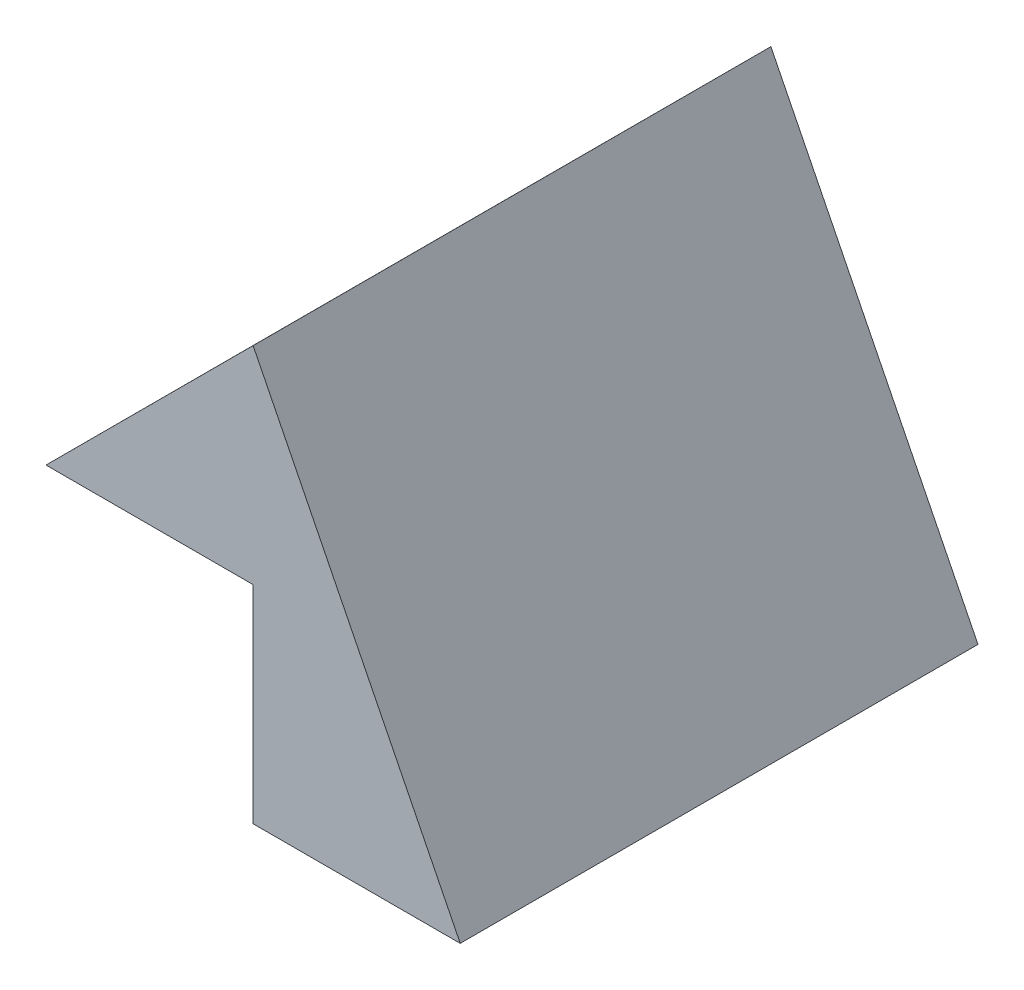
ISO-10303-21;
HEADER;
FILE_DESCRIPTION(('STEP AP214'),'2;1');
FILE_NAME('part.step','',(''),(''),'','','');
FILE_SCHEMA(('AUTOMOTIVE_DESIGN { 1 0 10303 214 1 1 1 1 }'));
ENDSEC;
DATA;
#1=APPLICATION_CONTEXT('core data for automotive mechanical design processes');
#2=APPLICATION_PROTOCOL_DEFINITION('international standard','automotive_design',2000,#1);
#3=PRODUCT_CONTEXT('',#1,'mechanical');
#4=PRODUCT('Part','Part','',(#3));
#5=PRODUCT_RELATED_PRODUCT_CATEGORY('part','',(#4));
#6=PRODUCT_DEFINITION_FORMATION('','',#4);
#7=PRODUCT_DEFINITION_CONTEXT('part definition',#1,'design');
#8=PRODUCT_DEFINITION('design','',#6,#7);
#9=PRODUCT_DEFINITION_SHAPE('','',#8);
#10=(LENGTH_UNIT() NAMED_UNIT(*) SI_UNIT(.MILLI.,.METRE.));
#11=(NAMED_UNIT(*) PLANE_ANGLE_UNIT() SI_UNIT($,.RADIAN.));
#12=(NAMED_UNIT(*) SI_UNIT($,.STERADIAN.) SOLID_ANGLE_UNIT());
#13=UNCERTAINTY_MEASURE_WITH_UNIT(LENGTH_MEASURE(1.E-05),#10,'distance_accuracy_value','');
#14=(GEOMETRIC_REPRESENTATION_CONTEXT(3) GLOBAL_UNCERTAINTY_ASSIGNED_CONTEXT((#13)) GLOBAL_UNIT_ASSIGNED_CONTEXT((#10,
#11,#12)) REPRESENTATION_CONTEXT('',''));
#15=CARTESIAN_POINT('',(0.,0.,0.));
#16=DIRECTION('',(0.,0.,1.));
#17=DIRECTION('',(1.,0.,0.));
#18=AXIS2_PLACEMENT_3D('',#15,#16,#17);
#19=CARTESIAN_POINT('',(-10.,10.,25.));
#20=DIRECTION('',(0.,1.,0.));
#21=DIRECTION('',(0.,0.,1.));
#22=AXIS2_PLACEMENT_3D('',#19,#20,#21);
#23=PLANE('',#22);
#24=DIRECTION('',(1.,0.,0.));
#25=VECTOR('',#24,1.);
#26=CARTESIAN_POINT('',(-10.,10.,0.));
#27=LINE('',#26,#25);
#28=CARTESIAN_POINT('',(-20.,10.,0.));
#29=VERTEX_POINT('',#28);
#30=CARTESIAN_POINT('',(-10.,10.,0.));
#31=VERTEX_POINT('',#30);
#32=EDGE_CURVE('E107',#29,#31,#27,.T.);
#33=ORIENTED_EDGE('',*,*,#32,.T.);
#34=DIRECTION('',(0.,0.,-1.));
#35=VECTOR('',#34,1.);
#36=CARTESIAN_POINT('',(-10.,10.,25.));
#37=LINE('',#36,#35);
#38=CARTESIAN_POINT('',(-10.,10.,25.));
#39=VERTEX_POINT('',#38);
#40=EDGE_CURVE('E11',#39,#31,#37,.T.);
#41=ORIENTED_EDGE('',*,*,#40,.F.);
#42=DIRECTION('',(1.,0.,0.));
#43=VECTOR('',#42,1.);
#44=CARTESIAN_POINT('',(-10.,10.,25.));
#45=LINE('',#44,#43);
#46=CARTESIAN_POINT('',(-20.,10.,25.));
#47=VERTEX_POINT('',#46);
#48=EDGE_CURVE('E115',#47,#39,#45,.T.);
#49=ORIENTED_EDGE('',*,*,#48,.F.);
#50=DIRECTION('',(0.,0.,-1.));
#51=VECTOR('',#50,1.);
#52=CARTESIAN_POINT('',(-20.,10.,25.));
#53=LINE('',#52,#51);
#54=EDGE_CURVE('E103',#47,#29,#53,.T.);
#55=ORIENTED_EDGE('',*,*,#54,.T.);
#56=EDGE_LOOP('',(#33,#41,#49,#55));
#57=FACE_BOUND('',#56,.T.);
#58=ADVANCED_FACE('F33',(#57),#23,.F.);
#59=CARTESIAN_POINT('',(-10.,0.,25.));
#60=DIRECTION('',(1.,0.,0.));
#61=DIRECTION('',(0.,0.,-1.));
#62=AXIS2_PLACEMENT_3D('',#59,#60,#61);
#63=PLANE('',#62);
#64=DIRECTION('',(0.,-1.,0.));
#65=VECTOR('',#64,1.);
#66=CARTESIAN_POINT('',(-10.,0.,0.));
#67=LINE('',#66,#65);
#68=CARTESIAN_POINT('',(-10.,0.,0.));
#69=VERTEX_POINT('',#68);
#70=EDGE_CURVE('E110',#31,#69,#67,.T.);
#71=ORIENTED_EDGE('',*,*,#70,.T.);
#72=DIRECTION('',(0.,0.,-1.));
#73=VECTOR('',#72,1.);
#74=CARTESIAN_POINT('',(-10.,0.,25.));
#75=LINE('',#74,#73);
#76=CARTESIAN_POINT('',(-10.,0.,25.));
#77=VERTEX_POINT('',#76);
#78=EDGE_CURVE('E41',#77,#69,#75,.T.);
#79=ORIENTED_EDGE('',*,*,#78,.F.);
#80=DIRECTION('',(0.,-1.,0.));
#81=VECTOR('',#80,1.);
#82=CARTESIAN_POINT('',(-10.,0.,25.));
#83=LINE('',#82,#81);
#84=EDGE_CURVE('E83',#39,#77,#83,.T.);
#85=ORIENTED_EDGE('',*,*,#84,.F.);
#86=ORIENTED_EDGE('',*,*,#40,.T.);
#87=EDGE_LOOP('',(#71,#79,#85,#86));
#88=FACE_BOUND('',#87,.T.);
#89=ADVANCED_FACE('F134',(#88),#63,.F.);
#90=CARTESIAN_POINT('',(0.,0.,25.));
#91=DIRECTION('',(0.,1.,0.));
#92=DIRECTION('',(-1.,0.,0.));
#93=AXIS2_PLACEMENT_3D('',#90,#91,#92);
#94=PLANE('',#93);
#95=DIRECTION('',(1.,0.,0.));
#96=VECTOR('',#95,1.);
#97=CARTESIAN_POINT('',(0.,0.,0.));
#98=LINE('',#97,#96);
#99=CARTESIAN_POINT('',(0.,0.,0.));
#100=VERTEX_POINT('',#99);
#101=EDGE_CURVE('E98',#69,#100,#98,.T.);
#102=ORIENTED_EDGE('',*,*,#101,.T.);
#103=DIRECTION('',(0.,0.,-1.));
#104=VECTOR('',#103,1.);
#105=CARTESIAN_POINT('',(0.,0.,25.));
#106=LINE('',#105,#104);
#107=CARTESIAN_POINT('',(0.,0.,25.));
#108=VERTEX_POINT('',#107);
#109=EDGE_CURVE('E95',#108,#100,#106,.T.);
#110=ORIENTED_EDGE('',*,*,#109,.F.);
#111=DIRECTION('',(1.,0.,0.));
#112=VECTOR('',#111,1.);
#113=CARTESIAN_POINT('',(0.,0.,25.));
#114=LINE('',#113,#112);
#115=EDGE_CURVE('E87',#77,#108,#114,.T.);
#116=ORIENTED_EDGE('',*,*,#115,.F.);
#117=ORIENTED_EDGE('',*,*,#78,.T.);
#118=EDGE_LOOP('',(#102,#110,#116,#117));
#119=FACE_BOUND('',#118,.T.);
#120=ADVANCED_FACE('F96',(#119),#94,.F.);
#121=CARTESIAN_POINT('',(-10.,19.9960864735833,25.));
#122=DIRECTION('',(-0.894392179134649,-0.447283612378963,0.));
#123=DIRECTION('',(0.447283612378963,-0.894392179134649,0.));
#124=AXIS2_PLACEMENT_3D('',#121,#122,#123);
#125=PLANE('',#124);
#126=DIRECTION('',(-0.447283612378963,0.894392179134648,0.));
#127=VECTOR('',#126,1.);
#128=CARTESIAN_POINT('',(-10.,19.9960864735833,0.));
#129=LINE('',#128,#127);
#130=CARTESIAN_POINT('',(-10.,19.9960864735833,0.));
#131=VERTEX_POINT('',#130);
#132=EDGE_CURVE('E69',#100,#131,#129,.T.);
#133=ORIENTED_EDGE('',*,*,#132,.T.);
#134=DIRECTION('',(0.,0.,-1.));
#135=VECTOR('',#134,1.);
#136=CARTESIAN_POINT('',(-10.,19.9960864735833,25.));
#137=LINE('',#136,#135);
#138=CARTESIAN_POINT('',(-10.,19.9960864735833,25.));
#139=VERTEX_POINT('',#138);
#140=EDGE_CURVE('E99',#139,#131,#137,.T.);
#141=ORIENTED_EDGE('',*,*,#140,.F.);
#142=DIRECTION('',(-0.447283612378963,0.894392179134648,0.));
#143=VECTOR('',#142,1.);
#144=CARTESIAN_POINT('',(-10.,19.9960864735833,25.));
#145=LINE('',#144,#143);
#146=EDGE_CURVE('E91',#108,#139,#145,.T.);
#147=ORIENTED_EDGE('',*,*,#146,.F.);
#148=ORIENTED_EDGE('',*,*,#109,.T.);
#149=EDGE_LOOP('',(#133,#141,#147,#148));
#150=FACE_BOUND('',#149,.T.);
#151=ADVANCED_FACE('F101',(#150),#125,.F.);
#152=CARTESIAN_POINT('',(-20.,10.,25.));
#153=DIRECTION('',(0.706968376513368,-0.70724515877456,0.));
#154=DIRECTION('',(0.70724515877456,0.706968376513368,0.));
#155=AXIS2_PLACEMENT_3D('',#152,#153,#154);
#156=PLANE('',#155);
#157=DIRECTION('',(-0.70724515877456,-0.706968376513368,0.));
#158=VECTOR('',#157,1.);
#159=CARTESIAN_POINT('',(-20.,10.,0.));
#160=LINE('',#159,#158);
#161=EDGE_CURVE('E75',#131,#29,#160,.T.);
#162=ORIENTED_EDGE('',*,*,#161,.T.);
#163=ORIENTED_EDGE('',*,*,#54,.F.);
#164=DIRECTION('',(-0.70724515877456,-0.706968376513368,0.));
#165=VECTOR('',#164,1.);
#166=CARTESIAN_POINT('',(-20.,10.,25.));
#167=LINE('',#166,#165);
#168=EDGE_CURVE('E49',#139,#47,#167,.T.);
#169=ORIENTED_EDGE('',*,*,#168,.F.);
#170=ORIENTED_EDGE('',*,*,#140,.T.);
#171=EDGE_LOOP('',(#162,#163,#169,#170));
#172=FACE_BOUND('',#171,.T.);
#173=ADVANCED_FACE('F123',(#172),#156,.F.);
#174=CARTESIAN_POINT('',(0.,0.,25.));
#175=DIRECTION('',(0.,0.,-1.));
#176=DIRECTION('',(-1.,0.,0.));
#177=AXIS2_PLACEMENT_3D('',#174,#175,#176);
#178=PLANE('',#177);
#179=ORIENTED_EDGE('',*,*,#48,.T.);
#180=ORIENTED_EDGE('',*,*,#84,.T.);
#181=ORIENTED_EDGE('',*,*,#115,.T.);
#182=ORIENTED_EDGE('',*,*,#146,.T.);
#183=ORIENTED_EDGE('',*,*,#168,.T.);
#184=EDGE_LOOP('',(#179,#180,#181,#182,#183));
#185=FACE_BOUND('',#184,.T.);
#186=ADVANCED_FACE('F89',(#185),#178,.F.);
#187=CARTESIAN_POINT('',(0.,0.,0.));
#188=DIRECTION('',(0.,0.,-1.));
#189=DIRECTION('',(-1.,0.,0.));
#190=AXIS2_PLACEMENT_3D('',#187,#188,#189);
#191=PLANE('',#190);
#192=ORIENTED_EDGE('',*,*,#32,.F.);
#193=ORIENTED_EDGE('',*,*,#161,.F.);
#194=ORIENTED_EDGE('',*,*,#132,.F.);
#195=ORIENTED_EDGE('',*,*,#101,.F.);
#196=ORIENTED_EDGE('',*,*,#70,.F.);
#197=EDGE_LOOP('',(#192,#193,#194,#195,#196));
#198=FACE_BOUND('',#197,.T.);
#199=ADVANCED_FACE('F119',(#198),#191,.T.);
#200=CLOSED_SHELL('',(#58,#89,#120,#151,#173,#186,#199));
#201=MANIFOLD_SOLID_BREP('B2',#200);
#202=ADVANCED_BREP_SHAPE_REPRESENTATION('',(#18,#201),#14);
#203=SHAPE_DEFINITION_REPRESENTATION(#9,#202);
ENDSEC;
END-ISO-10303-21;
